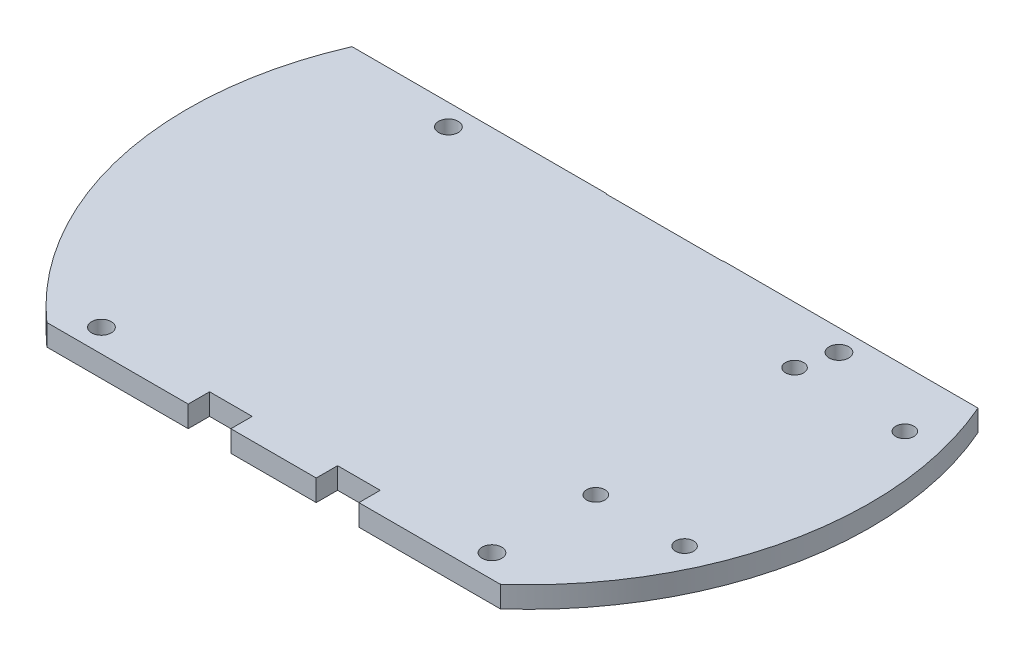
ISO-10303-21;
HEADER;
FILE_DESCRIPTION(('STEP AP214'),'2;1');
FILE_NAME('part.step','',(''),(''),'','','');
FILE_SCHEMA(('AUTOMOTIVE_DESIGN { 1 0 10303 214 1 1 1 1 }'));
ENDSEC;
DATA;
#1=APPLICATION_CONTEXT('core data for automotive mechanical design processes');
#2=APPLICATION_PROTOCOL_DEFINITION('international standard','automotive_design',2000,#1);
#3=PRODUCT_CONTEXT('',#1,'mechanical');
#4=PRODUCT('Part','Part','',(#3));
#5=PRODUCT_RELATED_PRODUCT_CATEGORY('part','',(#4));
#6=PRODUCT_DEFINITION_FORMATION('','',#4);
#7=PRODUCT_DEFINITION_CONTEXT('part definition',#1,'design');
#8=PRODUCT_DEFINITION('design','',#6,#7);
#9=PRODUCT_DEFINITION_SHAPE('','',#8);
#10=(LENGTH_UNIT() NAMED_UNIT(*) SI_UNIT(.MILLI.,.METRE.));
#11=(NAMED_UNIT(*) PLANE_ANGLE_UNIT() SI_UNIT($,.RADIAN.));
#12=(NAMED_UNIT(*) SI_UNIT($,.STERADIAN.) SOLID_ANGLE_UNIT());
#13=UNCERTAINTY_MEASURE_WITH_UNIT(LENGTH_MEASURE(1.E-05),#10,'distance_accuracy_value','');
#14=(GEOMETRIC_REPRESENTATION_CONTEXT(3) GLOBAL_UNCERTAINTY_ASSIGNED_CONTEXT((#13)) GLOBAL_UNIT_ASSIGNED_CONTEXT((#10,
#11,#12)) REPRESENTATION_CONTEXT('',''));
#15=CARTESIAN_POINT('',(0.,0.,0.));
#16=DIRECTION('',(0.,0.,1.));
#17=DIRECTION('',(1.,0.,0.));
#18=AXIS2_PLACEMENT_3D('',#15,#16,#17);
#19=CARTESIAN_POINT('',(-53.141111111781,0.,37.97808));
#20=DIRECTION('',(0.,0.,-1.));
#21=DIRECTION('',(-1.,0.,0.));
#22=AXIS2_PLACEMENT_3D('',#19,#20,#21);
#23=PLANE('',#22);
#24=DIRECTION('',(-1.,0.,0.));
#25=VECTOR('',#24,1.);
#26=CARTESIAN_POINT('',(-53.141111111781,3.175,37.97808));
#27=LINE('',#26,#25);
#28=CARTESIAN_POINT('',(33.7387824248831,3.175,37.97808));
#29=VERTEX_POINT('',#28);
#30=CARTESIAN_POINT('',(12.7,3.175,37.97808));
#31=VERTEX_POINT('',#30);
#32=EDGE_CURVE('E171',#29,#31,#27,.T.);
#33=ORIENTED_EDGE('',*,*,#32,.T.);
#34=DIRECTION('',(0.,-1.,0.));
#35=VECTOR('',#34,1.);
#36=CARTESIAN_POINT('',(12.7,3.175,37.97808));
#37=LINE('',#36,#35);
#38=CARTESIAN_POINT('',(12.7,0.,37.97808));
#39=VERTEX_POINT('',#38);
#40=EDGE_CURVE('E258',#31,#39,#37,.T.);
#41=ORIENTED_EDGE('',*,*,#40,.T.);
#42=DIRECTION('',(-1.,0.,0.));
#43=VECTOR('',#42,1.);
#44=CARTESIAN_POINT('',(0.,0.,37.97808));
#45=LINE('',#44,#43);
#46=CARTESIAN_POINT('',(33.7387824248831,0.,37.97808));
#47=VERTEX_POINT('',#46);
#48=EDGE_CURVE('E41',#47,#39,#45,.T.);
#49=ORIENTED_EDGE('',*,*,#48,.F.);
#50=DIRECTION('',(0.,-1.,0.));
#51=VECTOR('',#50,1.);
#52=CARTESIAN_POINT('',(33.7387824248831,3.175,37.97808));
#53=LINE('',#52,#51);
#54=EDGE_CURVE('E183',#29,#47,#53,.T.);
#55=ORIENTED_EDGE('',*,*,#54,.F.);
#56=EDGE_LOOP('',(#33,#41,#49,#55));
#57=FACE_BOUND('',#56,.T.);
#58=ADVANCED_FACE('F33',(#57),#23,.F.);
#59=CARTESIAN_POINT('',(6.35,0.,37.97808));
#60=VERTEX_POINT('',#59);
#61=CARTESIAN_POINT('',(-6.34999999999999,0.,37.97808));
#62=VERTEX_POINT('',#61);
#63=EDGE_CURVE('E161',#60,#62,#45,.T.);
#64=ORIENTED_EDGE('',*,*,#63,.F.);
#65=DIRECTION('',(0.,-1.,0.));
#66=VECTOR('',#65,1.);
#67=CARTESIAN_POINT('',(6.34999999999999,3.175,37.97808));
#68=LINE('',#67,#66);
#69=CARTESIAN_POINT('',(6.34999999999999,3.175,37.97808));
#70=VERTEX_POINT('',#69);
#71=EDGE_CURVE('E48',#70,#60,#68,.T.);
#72=ORIENTED_EDGE('',*,*,#71,.F.);
#73=CARTESIAN_POINT('',(-6.34999999999999,3.175,37.97808));
#74=VERTEX_POINT('',#73);
#75=EDGE_CURVE('E159',#70,#74,#27,.T.);
#76=ORIENTED_EDGE('',*,*,#75,.T.);
#77=DIRECTION('',(0.,-1.,0.));
#78=VECTOR('',#77,1.);
#79=CARTESIAN_POINT('',(-6.34999999999999,3.175,37.97808));
#80=LINE('',#79,#78);
#81=EDGE_CURVE('E447',#74,#62,#80,.T.);
#82=ORIENTED_EDGE('',*,*,#81,.T.);
#83=EDGE_LOOP('',(#64,#72,#76,#82));
#84=FACE_BOUND('',#83,.T.);
#85=ADVANCED_FACE('F157',(#84),#23,.F.);
#86=CARTESIAN_POINT('',(0.,3.175,0.));
#87=DIRECTION('',(0.,-1.,0.));
#88=DIRECTION('',(0.,0.,-1.));
#89=AXIS2_PLACEMENT_3D('',#86,#87,#88);
#90=CYLINDRICAL_SURFACE('',#89,50.8);
#91=CARTESIAN_POINT('',(0.,0.,0.));
#92=DIRECTION('',(0.,1.,0.));
#93=DIRECTION('',(0.,0.,1.));
#94=AXIS2_PLACEMENT_3D('',#91,#92,#93);
#95=CIRCLE('',#94,50.8);
#96=CARTESIAN_POINT('',(46.5785301430431,0.,-20.2751209543525));
#97=VERTEX_POINT('',#96);
#98=EDGE_CURVE('E255',#47,#97,#95,.T.);
#99=ORIENTED_EDGE('',*,*,#98,.T.);
#100=DIRECTION('',(0.,-1.,0.));
#101=VECTOR('',#100,1.);
#102=CARTESIAN_POINT('',(46.5785301430431,3.175,-20.2751209543525));
#103=LINE('',#102,#101);
#104=CARTESIAN_POINT('',(46.5785301430431,3.175,-20.2751209543525));
#105=VERTEX_POINT('',#104);
#106=EDGE_CURVE('E263',#97,#105,#103,.F.);
#107=ORIENTED_EDGE('',*,*,#106,.T.);
#108=CARTESIAN_POINT('',(0.,3.175,0.));
#109=DIRECTION('',(0.,1.,0.));
#110=DIRECTION('',(0.,0.,1.));
#111=AXIS2_PLACEMENT_3D('',#108,#109,#110);
#112=CIRCLE('',#111,50.8);
#113=EDGE_CURVE('E246',#29,#105,#112,.T.);
#114=ORIENTED_EDGE('',*,*,#113,.F.);
#115=ORIENTED_EDGE('',*,*,#54,.T.);
#116=EDGE_LOOP('',(#99,#107,#114,#115));
#117=FACE_BOUND('',#116,.T.);
#118=ADVANCED_FACE('F225',(#117),#90,.T.);
#119=CARTESIAN_POINT('',(-46.5785301430431,3.175,-20.2751209543525));
#120=VERTEX_POINT('',#119);
#121=CARTESIAN_POINT('',(-33.7387824248831,3.175,37.97808));
#122=VERTEX_POINT('',#121);
#123=EDGE_CURVE('E244',#120,#122,#112,.T.);
#124=ORIENTED_EDGE('',*,*,#123,.F.);
#125=DIRECTION('',(0.,-1.,0.));
#126=VECTOR('',#125,1.);
#127=CARTESIAN_POINT('',(-46.5785301430431,3.175,-20.2751209543525));
#128=LINE('',#127,#126);
#129=CARTESIAN_POINT('',(-46.5785301430431,0.,-20.2751209543525));
#130=VERTEX_POINT('',#129);
#131=EDGE_CURVE('E307',#120,#130,#128,.T.);
#132=ORIENTED_EDGE('',*,*,#131,.T.);
#133=CARTESIAN_POINT('',(-33.7387824248831,0.,37.97808));
#134=VERTEX_POINT('',#133);
#135=EDGE_CURVE('E265',#130,#134,#95,.T.);
#136=ORIENTED_EDGE('',*,*,#135,.T.);
#137=DIRECTION('',(0.,-1.,0.));
#138=VECTOR('',#137,1.);
#139=CARTESIAN_POINT('',(-33.7387824248831,3.175,37.97808));
#140=LINE('',#139,#138);
#141=EDGE_CURVE('E175',#134,#122,#140,.F.);
#142=ORIENTED_EDGE('',*,*,#141,.T.);
#143=EDGE_LOOP('',(#124,#132,#136,#142));
#144=FACE_BOUND('',#143,.T.);
#145=ADVANCED_FACE('F35',(#144),#90,.T.);
#146=CARTESIAN_POINT('',(0.,3.175,0.));
#147=DIRECTION('',(0.,1.,0.));
#148=DIRECTION('',(0.,0.,1.));
#149=AXIS2_PLACEMENT_3D('',#146,#147,#148);
#150=PLANE('',#149);
#151=CARTESIAN_POINT('',(29.3256006727526,3.175,19.3504084932935));
#152=DIRECTION('',(0.,1.,0.));
#153=DIRECTION('',(0.,0.,1.));
#154=AXIS2_PLACEMENT_3D('',#151,#152,#153);
#155=CIRCLE('',#154,1.34619999999676);
#156=CARTESIAN_POINT('',(29.3256006727526,3.175,20.6966084932903));
#157=VERTEX_POINT('',#156);
#158=EDGE_CURVE('E407',#157,#157,#155,.T.);
#159=ORIENTED_EDGE('',*,*,#158,.F.);
#160=EDGE_LOOP('',(#159));
#161=FACE_BOUND('',#160,.T.);
#162=CARTESIAN_POINT('',(42.5336006727526,3.175,19.3504084932945));
#163=DIRECTION('',(0.,1.,0.));
#164=DIRECTION('',(0.,0.,1.));
#165=AXIS2_PLACEMENT_3D('',#162,#163,#164);
#166=CIRCLE('',#165,1.34619999999676);
#167=CARTESIAN_POINT('',(42.5336006727526,3.175,20.6966084932913));
#168=VERTEX_POINT('',#167);
#169=EDGE_CURVE('E409',#168,#168,#166,.T.);
#170=ORIENTED_EDGE('',*,*,#169,.F.);
#171=EDGE_LOOP('',(#170));
#172=FACE_BOUND('',#171,.T.);
#173=CARTESIAN_POINT('',(44.1338006727549,3.175,-11.8280915067054));
#174=DIRECTION('',(0.,1.,0.));
#175=DIRECTION('',(0.,0.,1.));
#176=AXIS2_PLACEMENT_3D('',#173,#174,#175);
#177=CIRCLE('',#176,1.34619999999676);
#178=CARTESIAN_POINT('',(44.1338006727549,3.175,-10.4818915067086));
#179=VERTEX_POINT('',#178);
#180=EDGE_CURVE('E415',#179,#179,#177,.T.);
#181=ORIENTED_EDGE('',*,*,#180,.F.);
#182=EDGE_LOOP('',(#181));
#183=FACE_BOUND('',#182,.T.);
#184=CARTESIAN_POINT('',(27.7254006727549,3.175,-11.8280915067066));
#185=DIRECTION('',(0.,1.,0.));
#186=DIRECTION('',(0.,0.,1.));
#187=AXIS2_PLACEMENT_3D('',#184,#185,#186);
#188=CIRCLE('',#187,1.34619999999676);
#189=CARTESIAN_POINT('',(27.7254006727549,3.175,-10.4818915067099));
#190=VERTEX_POINT('',#189);
#191=EDGE_CURVE('E421',#190,#190,#188,.T.);
#192=ORIENTED_EDGE('',*,*,#191,.F.);
#193=EDGE_LOOP('',(#192));
#194=FACE_BOUND('',#193,.T.);
#195=DIRECTION('',(0.,0.,1.));
#196=VECTOR('',#195,1.);
#197=CARTESIAN_POINT('',(12.7,3.175,37.97808));
#198=LINE('',#197,#196);
#199=CARTESIAN_POINT('',(12.7,3.175,34.80308));
#200=VERTEX_POINT('',#199);
#201=EDGE_CURVE('E162',#200,#31,#198,.T.);
#202=ORIENTED_EDGE('',*,*,#201,.T.);
#203=ORIENTED_EDGE('',*,*,#32,.F.);
#204=ORIENTED_EDGE('',*,*,#113,.T.);
#205=DIRECTION('',(-1.,0.,0.));
#206=VECTOR('',#205,1.);
#207=CARTESIAN_POINT('',(-63.0503878112092,3.175,-20.2751209543525));
#208=LINE('',#207,#206);
#209=CARTESIAN_POINT('',(8.6964080083546,3.175,-20.2751209543525));
#210=VERTEX_POINT('',#209);
#211=EDGE_CURVE('E308',#105,#210,#208,.T.);
#212=ORIENTED_EDGE('',*,*,#211,.T.);
#213=CARTESIAN_POINT('',(8.59710332212168,3.175,-20.19808));
#214=CARTESIAN_POINT('',(17.0380821659998,3.175,-26.7142867821957));
#215=CARTESIAN_POINT('',(17.4664054862569,3.175,-37.97808));
#216=B_SPLINE_CURVE_WITH_KNOTS('',2,(#213,#214,#215),.UNSPECIFIED.,.F.,.F.,(3,3),(0.,1.),.UNSPECIFIED.);
#217=CARTESIAN_POINT('',(8.59710332212168,3.175,-20.19808));
#218=VERTEX_POINT('',#217);
#219=EDGE_CURVE('E193',#218,#210,#216,.T.);
#220=ORIENTED_EDGE('',*,*,#219,.F.);
#221=DIRECTION('',(1.,0.,0.));
#222=VECTOR('',#221,1.);
#223=CARTESIAN_POINT('',(-8.59710332212168,3.175,-20.19808));
#224=LINE('',#223,#222);
#225=CARTESIAN_POINT('',(-8.59710332212168,3.175,-20.19808));
#226=VERTEX_POINT('',#225);
#227=EDGE_CURVE('E277',#226,#218,#224,.T.);
#228=ORIENTED_EDGE('',*,*,#227,.F.);
#229=CARTESIAN_POINT('',(-17.4664054862569,3.175,-37.97808));
#230=CARTESIAN_POINT('',(-17.0380821659998,3.175,-26.7142867821957));
#231=CARTESIAN_POINT('',(-8.59710332212168,3.175,-20.19808));
#232=B_SPLINE_CURVE_WITH_KNOTS('',2,(#229,#230,#231),.UNSPECIFIED.,.F.,.F.,(3,3),(0.,1.),.UNSPECIFIED.);
#233=CARTESIAN_POINT('',(-8.69640800835466,3.175,-20.2751209543554));
#234=VERTEX_POINT('',#233);
#235=EDGE_CURVE('E186',#234,#226,#232,.T.);
#236=ORIENTED_EDGE('',*,*,#235,.F.);
#237=EDGE_CURVE('E312',#234,#120,#208,.T.);
#238=ORIENTED_EDGE('',*,*,#237,.T.);
#239=ORIENTED_EDGE('',*,*,#123,.T.);
#240=CARTESIAN_POINT('',(-12.7,3.175,37.97808));
#241=VERTEX_POINT('',#240);
#242=EDGE_CURVE('E172',#241,#122,#27,.T.);
#243=ORIENTED_EDGE('',*,*,#242,.F.);
#244=DIRECTION('',(0.,0.,-1.));
#245=VECTOR('',#244,1.);
#246=CARTESIAN_POINT('',(-12.7,3.175,37.97808));
#247=LINE('',#246,#245);
#248=CARTESIAN_POINT('',(-12.7,3.175,34.80308));
#249=VERTEX_POINT('',#248);
#250=EDGE_CURVE('E56',#241,#249,#247,.T.);
#251=ORIENTED_EDGE('',*,*,#250,.T.);
#252=DIRECTION('',(1.,0.,0.));
#253=VECTOR('',#252,1.);
#254=CARTESIAN_POINT('',(-6.35,3.175,34.80308));
#255=LINE('',#254,#253);
#256=CARTESIAN_POINT('',(-6.35,3.175,34.80308));
#257=VERTEX_POINT('',#256);
#258=EDGE_CURVE('E445',#249,#257,#255,.T.);
#259=ORIENTED_EDGE('',*,*,#258,.T.);
#260=DIRECTION('',(0.,0.,1.));
#261=VECTOR('',#260,1.);
#262=CARTESIAN_POINT('',(-6.34999999999999,3.175,37.97808));
#263=LINE('',#262,#261);
#264=EDGE_CURVE('E170',#257,#74,#263,.T.);
#265=ORIENTED_EDGE('',*,*,#264,.T.);
#266=ORIENTED_EDGE('',*,*,#75,.F.);
#267=DIRECTION('',(0.,0.,-1.));
#268=VECTOR('',#267,1.);
#269=CARTESIAN_POINT('',(6.34999999999999,3.175,37.97808));
#270=LINE('',#269,#268);
#271=CARTESIAN_POINT('',(6.35,3.175,34.80308));
#272=VERTEX_POINT('',#271);
#273=EDGE_CURVE('E145',#70,#272,#270,.T.);
#274=ORIENTED_EDGE('',*,*,#273,.T.);
#275=DIRECTION('',(1.,0.,0.));
#276=VECTOR('',#275,1.);
#277=CARTESIAN_POINT('',(6.35,3.175,34.80308));
#278=LINE('',#277,#276);
#279=EDGE_CURVE('E152',#272,#200,#278,.T.);
#280=ORIENTED_EDGE('',*,*,#279,.T.);
#281=EDGE_LOOP('',(#202,#203,#204,#212,#220,#228,#236,#238,#239,#243,#251,#259,#265,#266,#274,#280));
#282=FACE_BOUND('',#281,.T.);
#283=CARTESIAN_POINT('',(-29.0575999999995,3.175,34.53638));
#284=DIRECTION('',(0.,1.,0.));
#285=DIRECTION('',(0.,0.,1.));
#286=AXIS2_PLACEMENT_3D('',#283,#284,#285);
#287=CIRCLE('',#286,1.4605);
#288=CARTESIAN_POINT('',(-29.0575999999995,3.175,35.99688));
#289=VERTEX_POINT('',#288);
#290=EDGE_CURVE('E318',#289,#289,#287,.T.);
#291=ORIENTED_EDGE('',*,*,#290,.F.);
#292=EDGE_LOOP('',(#291));
#293=FACE_BOUND('',#292,.T.);
#294=CARTESIAN_POINT('',(29.0576000000006,3.175,34.5363799999997));
#295=DIRECTION('',(0.,1.,0.));
#296=DIRECTION('',(0.,0.,1.));
#297=AXIS2_PLACEMENT_3D('',#294,#295,#296);
#298=CIRCLE('',#297,1.4605);
#299=CARTESIAN_POINT('',(29.0576000000006,3.175,35.9968799999997));
#300=VERTEX_POINT('',#299);
#301=EDGE_CURVE('E322',#300,#300,#298,.T.);
#302=ORIENTED_EDGE('',*,*,#301,.F.);
#303=EDGE_LOOP('',(#302));
#304=FACE_BOUND('',#303,.T.);
#305=CARTESIAN_POINT('',(29.0576000000003,3.175,-17.1018200000003));
#306=DIRECTION('',(0.,1.,0.));
#307=DIRECTION('',(0.,0.,1.));
#308=AXIS2_PLACEMENT_3D('',#305,#306,#307);
#309=CIRCLE('',#308,1.4605);
#310=CARTESIAN_POINT('',(29.0576000000003,3.175,-15.6413200000003));
#311=VERTEX_POINT('',#310);
#312=EDGE_CURVE('E328',#311,#311,#309,.T.);
#313=ORIENTED_EDGE('',*,*,#312,.F.);
#314=EDGE_LOOP('',(#313));
#315=FACE_BOUND('',#314,.T.);
#316=CARTESIAN_POINT('',(-29.0575999999997,3.175,-17.10182));
#317=DIRECTION('',(0.,1.,0.));
#318=DIRECTION('',(0.,0.,1.));
#319=AXIS2_PLACEMENT_3D('',#316,#317,#318);
#320=CIRCLE('',#319,1.4605);
#321=CARTESIAN_POINT('',(-29.0575999999997,3.175,-15.64132));
#322=VERTEX_POINT('',#321);
#323=EDGE_CURVE('E179',#322,#322,#320,.T.);
#324=ORIENTED_EDGE('',*,*,#323,.F.);
#325=EDGE_LOOP('',(#324));
#326=FACE_BOUND('',#325,.T.);
#327=ADVANCED_FACE('F166',(#161,#172,#183,#194,#282,#293,#304,#315,#326),#150,.T.);
#328=CARTESIAN_POINT('',(0.,0.,0.));
#329=DIRECTION('',(0.,1.,0.));
#330=DIRECTION('',(0.,0.,1.));
#331=AXIS2_PLACEMENT_3D('',#328,#329,#330);
#332=PLANE('',#331);
#333=CARTESIAN_POINT('',(29.3256006727526,0.,19.3504084932935));
#334=DIRECTION('',(0.,1.,0.));
#335=DIRECTION('',(0.,0.,1.));
#336=AXIS2_PLACEMENT_3D('',#333,#334,#335);
#337=CIRCLE('',#336,1.34619999999676);
#338=CARTESIAN_POINT('',(29.3256006727526,0.,20.6966084932903));
#339=VERTEX_POINT('',#338);
#340=EDGE_CURVE('E404',#339,#339,#337,.T.);
#341=ORIENTED_EDGE('',*,*,#340,.T.);
#342=EDGE_LOOP('',(#341));
#343=FACE_BOUND('',#342,.T.);
#344=CARTESIAN_POINT('',(42.5336006727526,0.,19.3504084932945));
#345=DIRECTION('',(0.,1.,0.));
#346=DIRECTION('',(0.,0.,1.));
#347=AXIS2_PLACEMENT_3D('',#344,#345,#346);
#348=CIRCLE('',#347,1.34619999999676);
#349=CARTESIAN_POINT('',(42.5336006727526,0.,20.6966084932913));
#350=VERTEX_POINT('',#349);
#351=EDGE_CURVE('E412',#350,#350,#348,.T.);
#352=ORIENTED_EDGE('',*,*,#351,.T.);
#353=EDGE_LOOP('',(#352));
#354=FACE_BOUND('',#353,.T.);
#355=CARTESIAN_POINT('',(44.1338006727549,0.,-11.8280915067054));
#356=DIRECTION('',(0.,1.,0.));
#357=DIRECTION('',(0.,0.,1.));
#358=AXIS2_PLACEMENT_3D('',#355,#356,#357);
#359=CIRCLE('',#358,1.34619999999676);
#360=CARTESIAN_POINT('',(44.1338006727549,0.,-10.4818915067086));
#361=VERTEX_POINT('',#360);
#362=EDGE_CURVE('E418',#361,#361,#359,.T.);
#363=ORIENTED_EDGE('',*,*,#362,.T.);
#364=EDGE_LOOP('',(#363));
#365=FACE_BOUND('',#364,.T.);
#366=CARTESIAN_POINT('',(27.7254006727549,0.,-11.8280915067066));
#367=DIRECTION('',(0.,1.,0.));
#368=DIRECTION('',(0.,0.,1.));
#369=AXIS2_PLACEMENT_3D('',#366,#367,#368);
#370=CIRCLE('',#369,1.34619999999676);
#371=CARTESIAN_POINT('',(27.7254006727549,0.,-10.4818915067099));
#372=VERTEX_POINT('',#371);
#373=EDGE_CURVE('E424',#372,#372,#370,.T.);
#374=ORIENTED_EDGE('',*,*,#373,.T.);
#375=EDGE_LOOP('',(#374));
#376=FACE_BOUND('',#375,.T.);
#377=CARTESIAN_POINT('',(-29.0575999999995,0.,34.53638));
#378=DIRECTION('',(0.,1.,0.));
#379=DIRECTION('',(0.,0.,1.));
#380=AXIS2_PLACEMENT_3D('',#377,#378,#379);
#381=CIRCLE('',#380,1.4605);
#382=CARTESIAN_POINT('',(-29.0575999999995,0.,35.99688));
#383=VERTEX_POINT('',#382);
#384=EDGE_CURVE('E319',#383,#383,#381,.T.);
#385=ORIENTED_EDGE('',*,*,#384,.T.);
#386=EDGE_LOOP('',(#385));
#387=FACE_BOUND('',#386,.T.);
#388=CARTESIAN_POINT('',(29.0576000000006,0.,34.5363799999997));
#389=DIRECTION('',(0.,1.,0.));
#390=DIRECTION('',(0.,0.,1.));
#391=AXIS2_PLACEMENT_3D('',#388,#389,#390);
#392=CIRCLE('',#391,1.4605);
#393=CARTESIAN_POINT('',(29.0576000000006,0.,35.9968799999997));
#394=VERTEX_POINT('',#393);
#395=EDGE_CURVE('E325',#394,#394,#392,.T.);
#396=ORIENTED_EDGE('',*,*,#395,.T.);
#397=EDGE_LOOP('',(#396));
#398=FACE_BOUND('',#397,.T.);
#399=CARTESIAN_POINT('',(29.0576000000003,0.,-17.1018200000003));
#400=DIRECTION('',(0.,1.,0.));
#401=DIRECTION('',(0.,0.,1.));
#402=AXIS2_PLACEMENT_3D('',#399,#400,#401);
#403=CIRCLE('',#402,1.4605);
#404=CARTESIAN_POINT('',(29.0576000000003,0.,-15.6413200000003));
#405=VERTEX_POINT('',#404);
#406=EDGE_CURVE('E331',#405,#405,#403,.T.);
#407=ORIENTED_EDGE('',*,*,#406,.T.);
#408=EDGE_LOOP('',(#407));
#409=FACE_BOUND('',#408,.T.);
#410=CARTESIAN_POINT('',(-29.0575999999997,0.,-17.10182));
#411=DIRECTION('',(0.,1.,0.));
#412=DIRECTION('',(0.,0.,1.));
#413=AXIS2_PLACEMENT_3D('',#410,#411,#412);
#414=CIRCLE('',#413,1.4605);
#415=CARTESIAN_POINT('',(-29.0575999999997,0.,-15.64132));
#416=VERTEX_POINT('',#415);
#417=EDGE_CURVE('E176',#416,#416,#414,.T.);
#418=ORIENTED_EDGE('',*,*,#417,.T.);
#419=EDGE_LOOP('',(#418));
#420=FACE_BOUND('',#419,.T.);
#421=ORIENTED_EDGE('',*,*,#48,.T.);
#422=DIRECTION('',(0.,0.,1.));
#423=VECTOR('',#422,1.);
#424=CARTESIAN_POINT('',(12.7,0.,37.97808));
#425=LINE('',#424,#423);
#426=CARTESIAN_POINT('',(12.7,0.,34.80308));
#427=VERTEX_POINT('',#426);
#428=EDGE_CURVE('E153',#427,#39,#425,.T.);
#429=ORIENTED_EDGE('',*,*,#428,.F.);
#430=DIRECTION('',(1.,0.,0.));
#431=VECTOR('',#430,1.);
#432=CARTESIAN_POINT('',(6.35,0.,34.80308));
#433=LINE('',#432,#431);
#434=CARTESIAN_POINT('',(6.35,0.,34.80308));
#435=VERTEX_POINT('',#434);
#436=EDGE_CURVE('E433',#435,#427,#433,.T.);
#437=ORIENTED_EDGE('',*,*,#436,.F.);
#438=DIRECTION('',(0.,0.,-1.));
#439=VECTOR('',#438,1.);
#440=CARTESIAN_POINT('',(6.34999999999999,0.,37.97808));
#441=LINE('',#440,#439);
#442=EDGE_CURVE('E427',#60,#435,#441,.T.);
#443=ORIENTED_EDGE('',*,*,#442,.F.);
#444=ORIENTED_EDGE('',*,*,#63,.T.);
#445=DIRECTION('',(0.,0.,1.));
#446=VECTOR('',#445,1.);
#447=CARTESIAN_POINT('',(-6.34999999999999,0.,37.97808));
#448=LINE('',#447,#446);
#449=CARTESIAN_POINT('',(-6.35,0.,34.80308));
#450=VERTEX_POINT('',#449);
#451=EDGE_CURVE('E438',#450,#62,#448,.T.);
#452=ORIENTED_EDGE('',*,*,#451,.F.);
#453=DIRECTION('',(1.,0.,0.));
#454=VECTOR('',#453,1.);
#455=CARTESIAN_POINT('',(-6.35,0.,34.80308));
#456=LINE('',#455,#454);
#457=CARTESIAN_POINT('',(-12.7,0.,34.80308));
#458=VERTEX_POINT('',#457);
#459=EDGE_CURVE('E443',#458,#450,#456,.T.);
#460=ORIENTED_EDGE('',*,*,#459,.F.);
#461=DIRECTION('',(0.,0.,-1.));
#462=VECTOR('',#461,1.);
#463=CARTESIAN_POINT('',(-12.7,0.,37.97808));
#464=LINE('',#463,#462);
#465=CARTESIAN_POINT('',(-12.7,0.,37.97808));
#466=VERTEX_POINT('',#465);
#467=EDGE_CURVE('E450',#466,#458,#464,.T.);
#468=ORIENTED_EDGE('',*,*,#467,.F.);
#469=EDGE_CURVE('E237',#466,#134,#45,.T.);
#470=ORIENTED_EDGE('',*,*,#469,.T.);
#471=ORIENTED_EDGE('',*,*,#135,.F.);
#472=DIRECTION('',(-1.,0.,0.));
#473=VECTOR('',#472,1.);
#474=CARTESIAN_POINT('',(-63.0503878112092,0.,-20.2751209543525));
#475=LINE('',#474,#473);
#476=CARTESIAN_POINT('',(-8.69640800835469,0.,-20.2751209543525));
#477=VERTEX_POINT('',#476);
#478=EDGE_CURVE('E315',#477,#130,#475,.T.);
#479=ORIENTED_EDGE('',*,*,#478,.F.);
#480=CARTESIAN_POINT('',(-17.4664054862569,0.,-37.97808));
#481=CARTESIAN_POINT('',(-17.0380821659998,0.,-26.7142867821957));
#482=CARTESIAN_POINT('',(-8.59710332212168,0.,-20.19808));
#483=B_SPLINE_CURVE_WITH_KNOTS('',2,(#480,#481,#482),.UNSPECIFIED.,.F.,.F.,(3,3),(0.,1.),.UNSPECIFIED.);
#484=CARTESIAN_POINT('',(-8.59710332212168,0.,-20.19808));
#485=VERTEX_POINT('',#484);
#486=EDGE_CURVE('E187',#477,#485,#483,.T.);
#487=ORIENTED_EDGE('',*,*,#486,.T.);
#488=DIRECTION('',(1.,0.,0.));
#489=VECTOR('',#488,1.);
#490=CARTESIAN_POINT('',(-8.59710332212168,0.,-20.19808));
#491=LINE('',#490,#489);
#492=CARTESIAN_POINT('',(8.59710332212168,0.,-20.19808));
#493=VERTEX_POINT('',#492);
#494=EDGE_CURVE('E192',#485,#493,#491,.T.);
#495=ORIENTED_EDGE('',*,*,#494,.T.);
#496=CARTESIAN_POINT('',(8.59710332212168,0.,-20.19808));
#497=CARTESIAN_POINT('',(17.0380821659998,0.,-26.7142867821957));
#498=CARTESIAN_POINT('',(17.4664054862569,0.,-37.97808));
#499=B_SPLINE_CURVE_WITH_KNOTS('',2,(#496,#497,#498),.UNSPECIFIED.,.F.,.F.,(3,3),(0.,1.),.UNSPECIFIED.);
#500=CARTESIAN_POINT('',(8.69640800835465,0.,-20.2751209543554));
#501=VERTEX_POINT('',#500);
#502=EDGE_CURVE('E271',#493,#501,#499,.T.);
#503=ORIENTED_EDGE('',*,*,#502,.T.);
#504=EDGE_CURVE('E461',#97,#501,#475,.T.);
#505=ORIENTED_EDGE('',*,*,#504,.F.);
#506=ORIENTED_EDGE('',*,*,#98,.F.);
#507=EDGE_LOOP('',(#421,#429,#437,#443,#444,#452,#460,#468,#470,#471,#479,#487,#495,#503,#505,#506));
#508=FACE_BOUND('',#507,.T.);
#509=ADVANCED_FACE('F208',(#343,#354,#365,#376,#387,#398,#409,#420,#508),#332,.F.);
#510=DIRECTION('',(0.,1.,0.));
#511=VECTOR('',#510,1.);
#512=SURFACE_OF_LINEAR_EXTRUSION('',#499,#511);
#513=ORIENTED_EDGE('',*,*,#219,.T.);
#514=DIRECTION('',(0.,1.,0.));
#515=VECTOR('',#514,1.);
#516=CARTESIAN_POINT('',(8.69640800835096,0.,-20.2751209543525));
#517=LINE('',#516,#515);
#518=EDGE_CURVE('E305',#210,#501,#517,.F.);
#519=ORIENTED_EDGE('',*,*,#518,.T.);
#520=ORIENTED_EDGE('',*,*,#502,.F.);
#521=DIRECTION('',(0.,1.,0.));
#522=VECTOR('',#521,1.);
#523=CARTESIAN_POINT('',(8.59710332212168,0.,-20.19808));
#524=LINE('',#523,#522);
#525=EDGE_CURVE('E270',#493,#218,#524,.T.);
#526=ORIENTED_EDGE('',*,*,#525,.T.);
#527=EDGE_LOOP('',(#513,#519,#520,#526));
#528=FACE_BOUND('',#527,.T.);
#529=ADVANCED_FACE('F211',(#528),#512,.F.);
#530=CARTESIAN_POINT('',(-8.59710332212168,0.,-20.19808));
#531=DIRECTION('',(0.,0.,1.));
#532=DIRECTION('',(1.,0.,0.));
#533=AXIS2_PLACEMENT_3D('',#530,#531,#532);
#534=PLANE('',#533);
#535=ORIENTED_EDGE('',*,*,#227,.T.);
#536=ORIENTED_EDGE('',*,*,#525,.F.);
#537=ORIENTED_EDGE('',*,*,#494,.F.);
#538=DIRECTION('',(0.,1.,0.));
#539=VECTOR('',#538,1.);
#540=CARTESIAN_POINT('',(-8.59710332212168,0.,-20.19808));
#541=LINE('',#540,#539);
#542=EDGE_CURVE('E267',#485,#226,#541,.T.);
#543=ORIENTED_EDGE('',*,*,#542,.T.);
#544=EDGE_LOOP('',(#535,#536,#537,#543));
#545=FACE_BOUND('',#544,.T.);
#546=ADVANCED_FACE('F204',(#545),#534,.F.);
#547=DIRECTION('',(0.,1.,0.));
#548=VECTOR('',#547,1.);
#549=SURFACE_OF_LINEAR_EXTRUSION('',#483,#548);
#550=ORIENTED_EDGE('',*,*,#486,.F.);
#551=DIRECTION('',(0.,1.,0.));
#552=VECTOR('',#551,1.);
#553=CARTESIAN_POINT('',(-8.69640800835096,0.,-20.2751209543525));
#554=LINE('',#553,#552);
#555=EDGE_CURVE('E11',#477,#234,#554,.T.);
#556=ORIENTED_EDGE('',*,*,#555,.T.);
#557=ORIENTED_EDGE('',*,*,#235,.T.);
#558=ORIENTED_EDGE('',*,*,#542,.F.);
#559=EDGE_LOOP('',(#550,#556,#557,#558));
#560=FACE_BOUND('',#559,.T.);
#561=ADVANCED_FACE('F199',(#560),#549,.F.);
#562=ORIENTED_EDGE('',*,*,#469,.F.);
#563=DIRECTION('',(0.,-1.,0.));
#564=VECTOR('',#563,1.);
#565=CARTESIAN_POINT('',(-12.7,3.175,37.97808));
#566=LINE('',#565,#564);
#567=EDGE_CURVE('E238',#241,#466,#566,.T.);
#568=ORIENTED_EDGE('',*,*,#567,.F.);
#569=ORIENTED_EDGE('',*,*,#242,.T.);
#570=ORIENTED_EDGE('',*,*,#141,.F.);
#571=EDGE_LOOP('',(#562,#568,#569,#570));
#572=FACE_BOUND('',#571,.T.);
#573=ADVANCED_FACE('F203',(#572),#23,.F.);
#574=CARTESIAN_POINT('',(-29.0575999999997,0.,-17.10182));
#575=DIRECTION('',(0.,1.,0.));
#576=DIRECTION('',(0.,0.,1.));
#577=AXIS2_PLACEMENT_3D('',#574,#575,#576);
#578=CYLINDRICAL_SURFACE('',#577,1.4605);
#579=ORIENTED_EDGE('',*,*,#417,.F.);
#580=EDGE_LOOP('',(#579));
#581=FACE_BOUND('',#580,.T.);
#582=ORIENTED_EDGE('',*,*,#323,.T.);
#583=EDGE_LOOP('',(#582));
#584=FACE_BOUND('',#583,.T.);
#585=ADVANCED_FACE('F228',(#581,#584),#578,.F.);
#586=CARTESIAN_POINT('',(29.0576000000003,0.,-17.1018200000003));
#587=DIRECTION('',(0.,1.,0.));
#588=DIRECTION('',(0.,0.,1.));
#589=AXIS2_PLACEMENT_3D('',#586,#587,#588);
#590=CYLINDRICAL_SURFACE('',#589,1.4605);
#591=ORIENTED_EDGE('',*,*,#406,.F.);
#592=EDGE_LOOP('',(#591));
#593=FACE_BOUND('',#592,.T.);
#594=ORIENTED_EDGE('',*,*,#312,.T.);
#595=EDGE_LOOP('',(#594));
#596=FACE_BOUND('',#595,.T.);
#597=ADVANCED_FACE('F233',(#593,#596),#590,.F.);
#598=CARTESIAN_POINT('',(29.0576000000006,0.,34.5363799999997));
#599=DIRECTION('',(0.,1.,0.));
#600=DIRECTION('',(0.,0.,1.));
#601=AXIS2_PLACEMENT_3D('',#598,#599,#600);
#602=CYLINDRICAL_SURFACE('',#601,1.4605);
#603=ORIENTED_EDGE('',*,*,#395,.F.);
#604=EDGE_LOOP('',(#603));
#605=FACE_BOUND('',#604,.T.);
#606=ORIENTED_EDGE('',*,*,#301,.T.);
#607=EDGE_LOOP('',(#606));
#608=FACE_BOUND('',#607,.T.);
#609=ADVANCED_FACE('F346',(#605,#608),#602,.F.);
#610=CARTESIAN_POINT('',(-29.0575999999995,0.,34.53638));
#611=DIRECTION('',(0.,1.,0.));
#612=DIRECTION('',(0.,0.,1.));
#613=AXIS2_PLACEMENT_3D('',#610,#611,#612);
#614=CYLINDRICAL_SURFACE('',#613,1.4605);
#615=ORIENTED_EDGE('',*,*,#384,.F.);
#616=EDGE_LOOP('',(#615));
#617=FACE_BOUND('',#616,.T.);
#618=ORIENTED_EDGE('',*,*,#290,.T.);
#619=EDGE_LOOP('',(#618));
#620=FACE_BOUND('',#619,.T.);
#621=ADVANCED_FACE('F352',(#617,#620),#614,.F.);
#622=CARTESIAN_POINT('',(-63.0503878112092,3.175,-20.2751209543525));
#623=DIRECTION('',(0.,0.,1.));
#624=DIRECTION('',(1.,0.,0.));
#625=AXIS2_PLACEMENT_3D('',#622,#623,#624);
#626=PLANE('',#625);
#627=ORIENTED_EDGE('',*,*,#237,.F.);
#628=ORIENTED_EDGE('',*,*,#555,.F.);
#629=ORIENTED_EDGE('',*,*,#478,.T.);
#630=ORIENTED_EDGE('',*,*,#131,.F.);
#631=EDGE_LOOP('',(#627,#628,#629,#630));
#632=FACE_BOUND('',#631,.T.);
#633=ADVANCED_FACE('F359',(#632),#626,.F.);
#634=ORIENTED_EDGE('',*,*,#504,.T.);
#635=ORIENTED_EDGE('',*,*,#518,.F.);
#636=ORIENTED_EDGE('',*,*,#211,.F.);
#637=ORIENTED_EDGE('',*,*,#106,.F.);
#638=EDGE_LOOP('',(#634,#635,#636,#637));
#639=FACE_BOUND('',#638,.T.);
#640=ADVANCED_FACE('F361',(#639),#626,.F.);
#641=CARTESIAN_POINT('',(-6.34999999999999,3.175,37.97808));
#642=DIRECTION('',(1.,0.,0.));
#643=DIRECTION('',(0.,0.,-1.));
#644=AXIS2_PLACEMENT_3D('',#641,#642,#643);
#645=PLANE('',#644);
#646=ORIENTED_EDGE('',*,*,#451,.T.);
#647=ORIENTED_EDGE('',*,*,#81,.F.);
#648=ORIENTED_EDGE('',*,*,#264,.F.);
#649=DIRECTION('',(0.,-1.,0.));
#650=VECTOR('',#649,1.);
#651=CARTESIAN_POINT('',(-6.35,3.175,34.80308));
#652=LINE('',#651,#650);
#653=EDGE_CURVE('E455',#257,#450,#652,.T.);
#654=ORIENTED_EDGE('',*,*,#653,.T.);
#655=EDGE_LOOP('',(#646,#647,#648,#654));
#656=FACE_BOUND('',#655,.T.);
#657=ADVANCED_FACE('F364',(#656),#645,.F.);
#658=CARTESIAN_POINT('',(-6.35,3.175,34.80308));
#659=DIRECTION('',(0.,0.,-1.));
#660=DIRECTION('',(-1.,0.,0.));
#661=AXIS2_PLACEMENT_3D('',#658,#659,#660);
#662=PLANE('',#661);
#663=ORIENTED_EDGE('',*,*,#459,.T.);
#664=ORIENTED_EDGE('',*,*,#653,.F.);
#665=ORIENTED_EDGE('',*,*,#258,.F.);
#666=DIRECTION('',(0.,-1.,0.));
#667=VECTOR('',#666,1.);
#668=CARTESIAN_POINT('',(-12.7,3.175,34.80308));
#669=LINE('',#668,#667);
#670=EDGE_CURVE('E457',#249,#458,#669,.T.);
#671=ORIENTED_EDGE('',*,*,#670,.T.);
#672=EDGE_LOOP('',(#663,#664,#665,#671));
#673=FACE_BOUND('',#672,.T.);
#674=ADVANCED_FACE('F367',(#673),#662,.F.);
#675=CARTESIAN_POINT('',(-12.7,3.175,37.97808));
#676=DIRECTION('',(-1.,0.,0.));
#677=DIRECTION('',(0.,0.,1.));
#678=AXIS2_PLACEMENT_3D('',#675,#676,#677);
#679=PLANE('',#678);
#680=ORIENTED_EDGE('',*,*,#467,.T.);
#681=ORIENTED_EDGE('',*,*,#670,.F.);
#682=ORIENTED_EDGE('',*,*,#250,.F.);
#683=ORIENTED_EDGE('',*,*,#567,.T.);
#684=EDGE_LOOP('',(#680,#681,#682,#683));
#685=FACE_BOUND('',#684,.T.);
#686=ADVANCED_FACE('F369',(#685),#679,.F.);
#687=CARTESIAN_POINT('',(12.7,3.175,37.97808));
#688=DIRECTION('',(1.,0.,0.));
#689=DIRECTION('',(0.,0.,-1.));
#690=AXIS2_PLACEMENT_3D('',#687,#688,#689);
#691=PLANE('',#690);
#692=ORIENTED_EDGE('',*,*,#428,.T.);
#693=ORIENTED_EDGE('',*,*,#40,.F.);
#694=ORIENTED_EDGE('',*,*,#201,.F.);
#695=DIRECTION('',(0.,-1.,0.));
#696=VECTOR('',#695,1.);
#697=CARTESIAN_POINT('',(12.7,3.175,34.80308));
#698=LINE('',#697,#696);
#699=EDGE_CURVE('E439',#200,#427,#698,.T.);
#700=ORIENTED_EDGE('',*,*,#699,.T.);
#701=EDGE_LOOP('',(#692,#693,#694,#700));
#702=FACE_BOUND('',#701,.T.);
#703=ADVANCED_FACE('F372',(#702),#691,.F.);
#704=CARTESIAN_POINT('',(6.35,3.175,34.80308));
#705=DIRECTION('',(0.,0.,-1.));
#706=DIRECTION('',(-1.,0.,0.));
#707=AXIS2_PLACEMENT_3D('',#704,#705,#706);
#708=PLANE('',#707);
#709=ORIENTED_EDGE('',*,*,#436,.T.);
#710=ORIENTED_EDGE('',*,*,#699,.F.);
#711=ORIENTED_EDGE('',*,*,#279,.F.);
#712=DIRECTION('',(0.,-1.,0.));
#713=VECTOR('',#712,1.);
#714=CARTESIAN_POINT('',(6.35,3.175,34.80308));
#715=LINE('',#714,#713);
#716=EDGE_CURVE('E147',#272,#435,#715,.T.);
#717=ORIENTED_EDGE('',*,*,#716,.T.);
#718=EDGE_LOOP('',(#709,#710,#711,#717));
#719=FACE_BOUND('',#718,.T.);
#720=ADVANCED_FACE('F379',(#719),#708,.F.);
#721=CARTESIAN_POINT('',(6.34999999999999,3.175,37.97808));
#722=DIRECTION('',(-1.,0.,0.));
#723=DIRECTION('',(0.,0.,1.));
#724=AXIS2_PLACEMENT_3D('',#721,#722,#723);
#725=PLANE('',#724);
#726=ORIENTED_EDGE('',*,*,#442,.T.);
#727=ORIENTED_EDGE('',*,*,#716,.F.);
#728=ORIENTED_EDGE('',*,*,#273,.F.);
#729=ORIENTED_EDGE('',*,*,#71,.T.);
#730=EDGE_LOOP('',(#726,#727,#728,#729));
#731=FACE_BOUND('',#730,.T.);
#732=ADVANCED_FACE('F146',(#731),#725,.F.);
#733=CARTESIAN_POINT('',(27.7254006727549,0.,-11.8280915067066));
#734=DIRECTION('',(0.,1.,0.));
#735=DIRECTION('',(0.,0.,1.));
#736=AXIS2_PLACEMENT_3D('',#733,#734,#735);
#737=CYLINDRICAL_SURFACE('',#736,1.34619999999676);
#738=ORIENTED_EDGE('',*,*,#373,.F.);
#739=EDGE_LOOP('',(#738));
#740=FACE_BOUND('',#739,.T.);
#741=ORIENTED_EDGE('',*,*,#191,.T.);
#742=EDGE_LOOP('',(#741));
#743=FACE_BOUND('',#742,.T.);
#744=ADVANCED_FACE('F378',(#740,#743),#737,.F.);
#745=CARTESIAN_POINT('',(44.1338006727549,0.,-11.8280915067054));
#746=DIRECTION('',(0.,1.,0.));
#747=DIRECTION('',(0.,0.,1.));
#748=AXIS2_PLACEMENT_3D('',#745,#746,#747);
#749=CYLINDRICAL_SURFACE('',#748,1.34619999999676);
#750=ORIENTED_EDGE('',*,*,#362,.F.);
#751=EDGE_LOOP('',(#750));
#752=FACE_BOUND('',#751,.T.);
#753=ORIENTED_EDGE('',*,*,#180,.T.);
#754=EDGE_LOOP('',(#753));
#755=FACE_BOUND('',#754,.T.);
#756=ADVANCED_FACE('F388',(#752,#755),#749,.F.);
#757=CARTESIAN_POINT('',(42.5336006727526,0.,19.3504084932945));
#758=DIRECTION('',(0.,1.,0.));
#759=DIRECTION('',(0.,0.,1.));
#760=AXIS2_PLACEMENT_3D('',#757,#758,#759);
#761=CYLINDRICAL_SURFACE('',#760,1.34619999999676);
#762=ORIENTED_EDGE('',*,*,#351,.F.);
#763=EDGE_LOOP('',(#762));
#764=FACE_BOUND('',#763,.T.);
#765=ORIENTED_EDGE('',*,*,#169,.T.);
#766=EDGE_LOOP('',(#765));
#767=FACE_BOUND('',#766,.T.);
#768=ADVANCED_FACE('F392',(#764,#767),#761,.F.);
#769=CARTESIAN_POINT('',(29.3256006727526,0.,19.3504084932935));
#770=DIRECTION('',(0.,1.,0.));
#771=DIRECTION('',(0.,0.,1.));
#772=AXIS2_PLACEMENT_3D('',#769,#770,#771);
#773=CYLINDRICAL_SURFACE('',#772,1.34619999999676);
#774=ORIENTED_EDGE('',*,*,#340,.F.);
#775=EDGE_LOOP('',(#774));
#776=FACE_BOUND('',#775,.T.);
#777=ORIENTED_EDGE('',*,*,#158,.T.);
#778=EDGE_LOOP('',(#777));
#779=FACE_BOUND('',#778,.T.);
#780=ADVANCED_FACE('F396',(#776,#779),#773,.F.);
#781=CLOSED_SHELL('',(#58,#85,#118,#145,#327,#509,#529,#546,#561,#573,#585,#597,#609,#621,#633,
#640,#657,#674,#686,#703,#720,#732,#744,#756,#768,#780));
#782=MANIFOLD_SOLID_BREP('B2',#781);
#783=ADVANCED_BREP_SHAPE_REPRESENTATION('',(#18,#782),#14);
#784=SHAPE_DEFINITION_REPRESENTATION(#9,#783);
ENDSEC;
END-ISO-10303-21;
